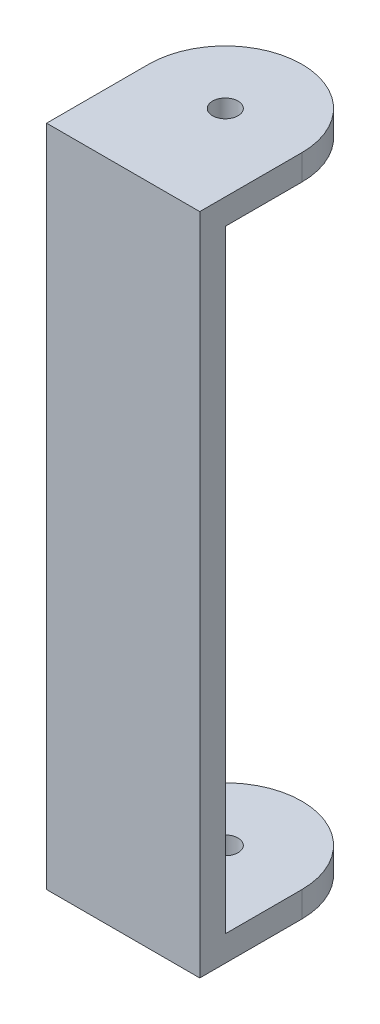
ISO-10303-21;
HEADER;
FILE_DESCRIPTION(('STEP AP214'),'2;1');
FILE_NAME('part.step','',(''),(''),'','','');
FILE_SCHEMA(('AUTOMOTIVE_DESIGN { 1 0 10303 214 1 1 1 1 }'));
ENDSEC;
DATA;
#1=APPLICATION_CONTEXT('core data for automotive mechanical design processes');
#2=APPLICATION_PROTOCOL_DEFINITION('international standard','automotive_design',2000,#1);
#3=PRODUCT_CONTEXT('',#1,'mechanical');
#4=PRODUCT('Part','Part','',(#3));
#5=PRODUCT_RELATED_PRODUCT_CATEGORY('part','',(#4));
#6=PRODUCT_DEFINITION_FORMATION('','',#4);
#7=PRODUCT_DEFINITION_CONTEXT('part definition',#1,'design');
#8=PRODUCT_DEFINITION('design','',#6,#7);
#9=PRODUCT_DEFINITION_SHAPE('','',#8);
#10=(LENGTH_UNIT() NAMED_UNIT(*) SI_UNIT(.MILLI.,.METRE.));
#11=(NAMED_UNIT(*) PLANE_ANGLE_UNIT() SI_UNIT($,.RADIAN.));
#12=(NAMED_UNIT(*) SI_UNIT($,.STERADIAN.) SOLID_ANGLE_UNIT());
#13=UNCERTAINTY_MEASURE_WITH_UNIT(LENGTH_MEASURE(1.E-05),#10,'distance_accuracy_value','');
#14=(GEOMETRIC_REPRESENTATION_CONTEXT(3) GLOBAL_UNCERTAINTY_ASSIGNED_CONTEXT((#13)) GLOBAL_UNIT_ASSIGNED_CONTEXT((#10,
#11,#12)) REPRESENTATION_CONTEXT('',''));
#15=CARTESIAN_POINT('',(0.,0.,0.));
#16=DIRECTION('',(0.,0.,1.));
#17=DIRECTION('',(1.,0.,0.));
#18=AXIS2_PLACEMENT_3D('',#15,#16,#17);
#19=CARTESIAN_POINT('',(0.,82.55,0.));
#20=DIRECTION('',(0.,-1.,0.));
#21=DIRECTION('',(0.,0.,-1.));
#22=AXIS2_PLACEMENT_3D('',#19,#20,#21);
#23=CYLINDRICAL_SURFACE('',#22,19.05);
#24=DIRECTION('',(0.,-1.,0.));
#25=VECTOR('',#24,1.);
#26=CARTESIAN_POINT('',(19.05,82.55,0.));
#27=LINE('',#26,#25);
#28=CARTESIAN_POINT('',(19.05,82.55,0.));
#29=VERTEX_POINT('',#28);
#30=CARTESIAN_POINT('',(19.05,76.2,0.));
#31=VERTEX_POINT('',#30);
#32=EDGE_CURVE('E165',#29,#31,#27,.T.);
#33=ORIENTED_EDGE('',*,*,#32,.T.);
#34=CARTESIAN_POINT('',(0.,76.2,0.));
#35=DIRECTION('',(0.,1.,0.));
#36=DIRECTION('',(0.,0.,1.));
#37=AXIS2_PLACEMENT_3D('',#34,#35,#36);
#38=CIRCLE('',#37,19.05);
#39=CARTESIAN_POINT('',(-19.05,76.2,0.));
#40=VERTEX_POINT('',#39);
#41=EDGE_CURVE('E141',#31,#40,#38,.T.);
#42=ORIENTED_EDGE('',*,*,#41,.T.);
#43=DIRECTION('',(0.,-1.,0.));
#44=VECTOR('',#43,1.);
#45=CARTESIAN_POINT('',(-19.05,82.55,0.));
#46=LINE('',#45,#44);
#47=CARTESIAN_POINT('',(-19.05,82.55,0.));
#48=VERTEX_POINT('',#47);
#49=EDGE_CURVE('E163',#48,#40,#46,.T.);
#50=ORIENTED_EDGE('',*,*,#49,.F.);
#51=CARTESIAN_POINT('',(0.,82.55,0.));
#52=DIRECTION('',(0.,1.,0.));
#53=DIRECTION('',(0.,0.,1.));
#54=AXIS2_PLACEMENT_3D('',#51,#52,#53);
#55=CIRCLE('',#54,19.05);
#56=EDGE_CURVE('E51',#29,#48,#55,.T.);
#57=ORIENTED_EDGE('',*,*,#56,.F.);
#58=EDGE_LOOP('',(#33,#42,#50,#57));
#59=FACE_BOUND('',#58,.T.);
#60=ADVANCED_FACE('F32',(#59),#23,.T.);
#61=CARTESIAN_POINT('',(0.,82.55,0.));
#62=DIRECTION('',(0.,-1.,0.));
#63=DIRECTION('',(0.,0.,-1.));
#64=AXIS2_PLACEMENT_3D('',#61,#62,#63);
#65=CYLINDRICAL_SURFACE('',#64,3.175);
#66=CARTESIAN_POINT('',(0.,76.2,0.));
#67=DIRECTION('',(0.,1.,0.));
#68=DIRECTION('',(0.,0.,1.));
#69=AXIS2_PLACEMENT_3D('',#66,#67,#68);
#70=CIRCLE('',#69,3.175);
#71=CARTESIAN_POINT('',(0.,76.2,3.175));
#72=VERTEX_POINT('',#71);
#73=EDGE_CURVE('E36',#72,#72,#70,.T.);
#74=ORIENTED_EDGE('',*,*,#73,.F.);
#75=EDGE_LOOP('',(#74));
#76=FACE_BOUND('',#75,.T.);
#77=CARTESIAN_POINT('',(0.,82.55,0.));
#78=DIRECTION('',(0.,1.,0.));
#79=DIRECTION('',(0.,0.,1.));
#80=AXIS2_PLACEMENT_3D('',#77,#78,#79);
#81=CIRCLE('',#80,3.175);
#82=CARTESIAN_POINT('',(0.,82.55,3.175));
#83=VERTEX_POINT('',#82);
#84=EDGE_CURVE('E144',#83,#83,#81,.T.);
#85=ORIENTED_EDGE('',*,*,#84,.T.);
#86=EDGE_LOOP('',(#85));
#87=FACE_BOUND('',#86,.T.);
#88=ADVANCED_FACE('F179',(#76,#87),#65,.F.);
#89=CARTESIAN_POINT('',(0.,82.55,0.));
#90=DIRECTION('',(0.,1.,0.));
#91=DIRECTION('',(0.,0.,1.));
#92=AXIS2_PLACEMENT_3D('',#89,#90,#91);
#93=PLANE('',#92);
#94=DIRECTION('',(0.,0.,1.));
#95=VECTOR('',#94,1.);
#96=CARTESIAN_POINT('',(-19.05,82.55,25.4));
#97=LINE('',#96,#95);
#98=CARTESIAN_POINT('',(-19.05,82.55,25.4));
#99=VERTEX_POINT('',#98);
#100=EDGE_CURVE('E150',#48,#99,#97,.T.);
#101=ORIENTED_EDGE('',*,*,#100,.T.);
#102=DIRECTION('',(1.,0.,0.));
#103=VECTOR('',#102,1.);
#104=CARTESIAN_POINT('',(-19.05,82.55,25.4));
#105=LINE('',#104,#103);
#106=CARTESIAN_POINT('',(19.05,82.55,25.4));
#107=VERTEX_POINT('',#106);
#108=EDGE_CURVE('E83',#99,#107,#105,.T.);
#109=ORIENTED_EDGE('',*,*,#108,.T.);
#110=DIRECTION('',(0.,0.,-1.));
#111=VECTOR('',#110,1.);
#112=CARTESIAN_POINT('',(19.05,82.55,25.4));
#113=LINE('',#112,#111);
#114=EDGE_CURVE('E154',#107,#29,#113,.T.);
#115=ORIENTED_EDGE('',*,*,#114,.T.);
#116=ORIENTED_EDGE('',*,*,#56,.T.);
#117=EDGE_LOOP('',(#101,#109,#115,#116));
#118=FACE_BOUND('',#117,.T.);
#119=ORIENTED_EDGE('',*,*,#84,.F.);
#120=EDGE_LOOP('',(#119));
#121=FACE_BOUND('',#120,.T.);
#122=ADVANCED_FACE('F184',(#118,#121),#93,.T.);
#123=CARTESIAN_POINT('',(0.,-82.55,0.));
#124=DIRECTION('',(0.,1.,0.));
#125=DIRECTION('',(0.,0.,1.));
#126=AXIS2_PLACEMENT_3D('',#123,#124,#125);
#127=PLANE('',#126);
#128=DIRECTION('',(0.,0.,1.));
#129=VECTOR('',#128,1.);
#130=CARTESIAN_POINT('',(-19.05,-82.55,25.4));
#131=LINE('',#130,#129);
#132=CARTESIAN_POINT('',(-19.05,-82.55,0.));
#133=VERTEX_POINT('',#132);
#134=CARTESIAN_POINT('',(-19.05,-82.55,25.4));
#135=VERTEX_POINT('',#134);
#136=EDGE_CURVE('E147',#133,#135,#131,.T.);
#137=ORIENTED_EDGE('',*,*,#136,.F.);
#138=CARTESIAN_POINT('',(0.,-82.55,0.));
#139=DIRECTION('',(0.,1.,0.));
#140=DIRECTION('',(0.,0.,1.));
#141=AXIS2_PLACEMENT_3D('',#138,#139,#140);
#142=CIRCLE('',#141,19.05);
#143=CARTESIAN_POINT('',(19.05,-82.55,0.));
#144=VERTEX_POINT('',#143);
#145=EDGE_CURVE('E152',#144,#133,#142,.T.);
#146=ORIENTED_EDGE('',*,*,#145,.F.);
#147=DIRECTION('',(0.,0.,-1.));
#148=VECTOR('',#147,1.);
#149=CARTESIAN_POINT('',(19.05,-82.55,25.4));
#150=LINE('',#149,#148);
#151=CARTESIAN_POINT('',(19.05,-82.55,25.4));
#152=VERTEX_POINT('',#151);
#153=EDGE_CURVE('E160',#152,#144,#150,.T.);
#154=ORIENTED_EDGE('',*,*,#153,.F.);
#155=DIRECTION('',(1.,0.,0.));
#156=VECTOR('',#155,1.);
#157=CARTESIAN_POINT('',(-19.05,-82.55,25.4));
#158=LINE('',#157,#156);
#159=EDGE_CURVE('E158',#135,#152,#158,.T.);
#160=ORIENTED_EDGE('',*,*,#159,.F.);
#161=EDGE_LOOP('',(#137,#146,#154,#160));
#162=FACE_BOUND('',#161,.T.);
#163=CARTESIAN_POINT('',(0.,-82.55,0.));
#164=DIRECTION('',(0.,1.,0.));
#165=DIRECTION('',(0.,0.,1.));
#166=AXIS2_PLACEMENT_3D('',#163,#164,#165);
#167=CIRCLE('',#166,3.175);
#168=CARTESIAN_POINT('',(0.,-82.55,3.175));
#169=VERTEX_POINT('',#168);
#170=EDGE_CURVE('E143',#169,#169,#167,.T.);
#171=ORIENTED_EDGE('',*,*,#170,.T.);
#172=EDGE_LOOP('',(#171));
#173=FACE_BOUND('',#172,.T.);
#174=ADVANCED_FACE('F182',(#162,#173),#127,.F.);
#175=CARTESIAN_POINT('',(-19.05,82.55,25.4));
#176=DIRECTION('',(1.,0.,0.));
#177=DIRECTION('',(0.,0.,-1.));
#178=AXIS2_PLACEMENT_3D('',#175,#176,#177);
#179=PLANE('',#178);
#180=ORIENTED_EDGE('',*,*,#49,.T.);
#181=DIRECTION('',(0.,0.,1.));
#182=VECTOR('',#181,1.);
#183=CARTESIAN_POINT('',(-19.05,76.2,19.05));
#184=LINE('',#183,#182);
#185=CARTESIAN_POINT('',(-19.05,76.2,19.05));
#186=VERTEX_POINT('',#185);
#187=EDGE_CURVE('E122',#40,#186,#184,.T.);
#188=ORIENTED_EDGE('',*,*,#187,.T.);
#189=DIRECTION('',(0.,-1.,0.));
#190=VECTOR('',#189,1.);
#191=CARTESIAN_POINT('',(-19.05,76.2,19.05));
#192=LINE('',#191,#190);
#193=CARTESIAN_POINT('',(-19.05,-76.2,19.05));
#194=VERTEX_POINT('',#193);
#195=EDGE_CURVE('E114',#186,#194,#192,.T.);
#196=ORIENTED_EDGE('',*,*,#195,.T.);
#197=DIRECTION('',(0.,0.,-1.));
#198=VECTOR('',#197,1.);
#199=CARTESIAN_POINT('',(-19.05,-76.2,19.05));
#200=LINE('',#199,#198);
#201=CARTESIAN_POINT('',(-19.05,-76.2,0.));
#202=VERTEX_POINT('',#201);
#203=EDGE_CURVE('E124',#194,#202,#200,.T.);
#204=ORIENTED_EDGE('',*,*,#203,.T.);
#205=EDGE_CURVE('E77',#202,#133,#46,.T.);
#206=ORIENTED_EDGE('',*,*,#205,.T.);
#207=ORIENTED_EDGE('',*,*,#136,.T.);
#208=DIRECTION('',(0.,-1.,0.));
#209=VECTOR('',#208,1.);
#210=CARTESIAN_POINT('',(-19.05,82.55,25.4));
#211=LINE('',#210,#209);
#212=EDGE_CURVE('E11',#99,#135,#211,.T.);
#213=ORIENTED_EDGE('',*,*,#212,.F.);
#214=ORIENTED_EDGE('',*,*,#100,.F.);
#215=EDGE_LOOP('',(#180,#188,#196,#204,#206,#207,#213,#214));
#216=FACE_BOUND('',#215,.T.);
#217=ADVANCED_FACE('F34',(#216),#179,.F.);
#218=CARTESIAN_POINT('',(-19.05,82.55,25.4));
#219=DIRECTION('',(0.,0.,-1.));
#220=DIRECTION('',(-1.,0.,0.));
#221=AXIS2_PLACEMENT_3D('',#218,#219,#220);
#222=PLANE('',#221);
#223=ORIENTED_EDGE('',*,*,#159,.T.);
#224=DIRECTION('',(0.,-1.,0.));
#225=VECTOR('',#224,1.);
#226=CARTESIAN_POINT('',(19.05,82.55,25.4));
#227=LINE('',#226,#225);
#228=EDGE_CURVE('E42',#107,#152,#227,.T.);
#229=ORIENTED_EDGE('',*,*,#228,.F.);
#230=ORIENTED_EDGE('',*,*,#108,.F.);
#231=ORIENTED_EDGE('',*,*,#212,.T.);
#232=EDGE_LOOP('',(#223,#229,#230,#231));
#233=FACE_BOUND('',#232,.T.);
#234=ADVANCED_FACE('F191',(#233),#222,.F.);
#235=CARTESIAN_POINT('',(19.05,82.55,25.4));
#236=DIRECTION('',(-1.,0.,0.));
#237=DIRECTION('',(0.,0.,1.));
#238=AXIS2_PLACEMENT_3D('',#235,#236,#237);
#239=PLANE('',#238);
#240=DIRECTION('',(0.,-1.,0.));
#241=VECTOR('',#240,1.);
#242=CARTESIAN_POINT('',(19.05,76.2,19.05));
#243=LINE('',#242,#241);
#244=CARTESIAN_POINT('',(19.05,76.2,19.05));
#245=VERTEX_POINT('',#244);
#246=CARTESIAN_POINT('',(19.05,-76.2,19.05));
#247=VERTEX_POINT('',#246);
#248=EDGE_CURVE('E117',#245,#247,#243,.T.);
#249=ORIENTED_EDGE('',*,*,#248,.F.);
#250=DIRECTION('',(0.,0.,1.));
#251=VECTOR('',#250,1.);
#252=CARTESIAN_POINT('',(19.05,76.2,19.05));
#253=LINE('',#252,#251);
#254=EDGE_CURVE('E130',#31,#245,#253,.T.);
#255=ORIENTED_EDGE('',*,*,#254,.F.);
#256=ORIENTED_EDGE('',*,*,#32,.F.);
#257=ORIENTED_EDGE('',*,*,#114,.F.);
#258=ORIENTED_EDGE('',*,*,#228,.T.);
#259=ORIENTED_EDGE('',*,*,#153,.T.);
#260=CARTESIAN_POINT('',(19.05,-76.2,0.));
#261=VERTEX_POINT('',#260);
#262=EDGE_CURVE('E69',#261,#144,#27,.T.);
#263=ORIENTED_EDGE('',*,*,#262,.F.);
#264=DIRECTION('',(0.,0.,-1.));
#265=VECTOR('',#264,1.);
#266=CARTESIAN_POINT('',(19.05,-76.2,19.05));
#267=LINE('',#266,#265);
#268=EDGE_CURVE('E132',#247,#261,#267,.T.);
#269=ORIENTED_EDGE('',*,*,#268,.F.);
#270=EDGE_LOOP('',(#249,#255,#256,#257,#258,#259,#263,#269));
#271=FACE_BOUND('',#270,.T.);
#272=ADVANCED_FACE('F203',(#271),#239,.F.);
#273=CARTESIAN_POINT('',(0.,-76.2,0.));
#274=DIRECTION('',(0.,-1.,0.));
#275=DIRECTION('',(0.,0.,-1.));
#276=AXIS2_PLACEMENT_3D('',#273,#274,#275);
#277=CIRCLE('',#276,19.05);
#278=EDGE_CURVE('E126',#202,#261,#277,.T.);
#279=ORIENTED_EDGE('',*,*,#278,.T.);
#280=ORIENTED_EDGE('',*,*,#262,.T.);
#281=ORIENTED_EDGE('',*,*,#145,.T.);
#282=ORIENTED_EDGE('',*,*,#205,.F.);
#283=EDGE_LOOP('',(#279,#280,#281,#282));
#284=FACE_BOUND('',#283,.T.);
#285=ADVANCED_FACE('F177',(#284),#23,.T.);
#286=CARTESIAN_POINT('',(0.,-76.2,0.));
#287=DIRECTION('',(0.,-1.,0.));
#288=DIRECTION('',(0.,0.,-1.));
#289=AXIS2_PLACEMENT_3D('',#286,#287,#288);
#290=CIRCLE('',#289,3.175);
#291=CARTESIAN_POINT('',(0.,-76.2,-3.175));
#292=VERTEX_POINT('',#291);
#293=EDGE_CURVE('E138',#292,#292,#290,.T.);
#294=ORIENTED_EDGE('',*,*,#293,.F.);
#295=EDGE_LOOP('',(#294));
#296=FACE_BOUND('',#295,.T.);
#297=ORIENTED_EDGE('',*,*,#170,.F.);
#298=EDGE_LOOP('',(#297));
#299=FACE_BOUND('',#298,.T.);
#300=ADVANCED_FACE('F173',(#296,#299),#65,.F.);
#301=CARTESIAN_POINT('',(-19.05,76.2,19.05));
#302=DIRECTION('',(0.,1.,0.));
#303=DIRECTION('',(0.,0.,1.));
#304=AXIS2_PLACEMENT_3D('',#301,#302,#303);
#305=PLANE('',#304);
#306=ORIENTED_EDGE('',*,*,#73,.T.);
#307=EDGE_LOOP('',(#306));
#308=FACE_BOUND('',#307,.T.);
#309=ORIENTED_EDGE('',*,*,#254,.T.);
#310=DIRECTION('',(1.,0.,0.));
#311=VECTOR('',#310,1.);
#312=CARTESIAN_POINT('',(-19.05,76.2,19.05));
#313=LINE('',#312,#311);
#314=EDGE_CURVE('E121',#186,#245,#313,.T.);
#315=ORIENTED_EDGE('',*,*,#314,.F.);
#316=ORIENTED_EDGE('',*,*,#187,.F.);
#317=ORIENTED_EDGE('',*,*,#41,.F.);
#318=EDGE_LOOP('',(#309,#315,#316,#317));
#319=FACE_BOUND('',#318,.T.);
#320=ADVANCED_FACE('F176',(#308,#319),#305,.F.);
#321=CARTESIAN_POINT('',(-19.05,-76.2,19.05));
#322=DIRECTION('',(0.,-1.,0.));
#323=DIRECTION('',(0.,0.,-1.));
#324=AXIS2_PLACEMENT_3D('',#321,#322,#323);
#325=PLANE('',#324);
#326=ORIENTED_EDGE('',*,*,#293,.T.);
#327=EDGE_LOOP('',(#326));
#328=FACE_BOUND('',#327,.T.);
#329=ORIENTED_EDGE('',*,*,#278,.F.);
#330=ORIENTED_EDGE('',*,*,#203,.F.);
#331=DIRECTION('',(1.,0.,0.));
#332=VECTOR('',#331,1.);
#333=CARTESIAN_POINT('',(-19.05,-76.2,19.05));
#334=LINE('',#333,#332);
#335=EDGE_CURVE('E109',#194,#247,#334,.T.);
#336=ORIENTED_EDGE('',*,*,#335,.T.);
#337=ORIENTED_EDGE('',*,*,#268,.T.);
#338=EDGE_LOOP('',(#329,#330,#336,#337));
#339=FACE_BOUND('',#338,.T.);
#340=ADVANCED_FACE('F125',(#328,#339),#325,.F.);
#341=CARTESIAN_POINT('',(-19.05,76.2,19.05));
#342=DIRECTION('',(0.,0.,1.));
#343=DIRECTION('',(0.,-1.,0.));
#344=AXIS2_PLACEMENT_3D('',#341,#342,#343);
#345=PLANE('',#344);
#346=ORIENTED_EDGE('',*,*,#248,.T.);
#347=ORIENTED_EDGE('',*,*,#335,.F.);
#348=ORIENTED_EDGE('',*,*,#195,.F.);
#349=ORIENTED_EDGE('',*,*,#314,.T.);
#350=EDGE_LOOP('',(#346,#347,#348,#349));
#351=FACE_BOUND('',#350,.T.);
#352=ADVANCED_FACE('F111',(#351),#345,.F.);
#353=CLOSED_SHELL('',(#60,#88,#122,#174,#217,#234,#272,#285,#300,#320,#340,#352));
#354=MANIFOLD_SOLID_BREP('B2',#353);
#355=ADVANCED_BREP_SHAPE_REPRESENTATION('',(#18,#354),#14);
#356=SHAPE_DEFINITION_REPRESENTATION(#9,#355);
ENDSEC;
END-ISO-10303-21;
